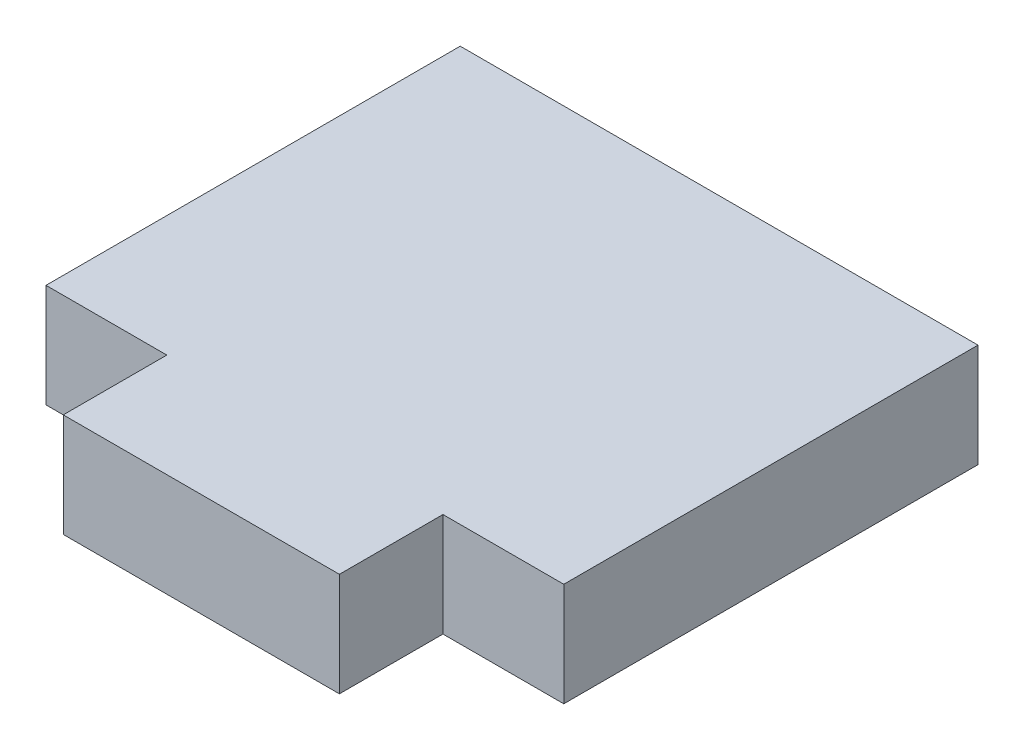
ISO-10303-21;
HEADER;
FILE_DESCRIPTION(('STEP AP214'),'2;1');
FILE_NAME('part.step','',(''),(''),'','','');
FILE_SCHEMA(('AUTOMOTIVE_DESIGN { 1 0 10303 214 1 1 1 1 }'));
ENDSEC;
DATA;
#1=APPLICATION_CONTEXT('core data for automotive mechanical design processes');
#2=APPLICATION_PROTOCOL_DEFINITION('international standard','automotive_design',2000,#1);
#3=PRODUCT_CONTEXT('',#1,'mechanical');
#4=PRODUCT('Part','Part','',(#3));
#5=PRODUCT_RELATED_PRODUCT_CATEGORY('part','',(#4));
#6=PRODUCT_DEFINITION_FORMATION('','',#4);
#7=PRODUCT_DEFINITION_CONTEXT('part definition',#1,'design');
#8=PRODUCT_DEFINITION('design','',#6,#7);
#9=PRODUCT_DEFINITION_SHAPE('','',#8);
#10=(LENGTH_UNIT() NAMED_UNIT(*) SI_UNIT(.MILLI.,.METRE.));
#11=(NAMED_UNIT(*) PLANE_ANGLE_UNIT() SI_UNIT($,.RADIAN.));
#12=(NAMED_UNIT(*) SI_UNIT($,.STERADIAN.) SOLID_ANGLE_UNIT());
#13=UNCERTAINTY_MEASURE_WITH_UNIT(LENGTH_MEASURE(1.E-05),#10,'distance_accuracy_value','');
#14=(GEOMETRIC_REPRESENTATION_CONTEXT(3) GLOBAL_UNCERTAINTY_ASSIGNED_CONTEXT((#13)) GLOBAL_UNIT_ASSIGNED_CONTEXT((#10,
#11,#12)) REPRESENTATION_CONTEXT('',''));
#15=CARTESIAN_POINT('',(0.,0.,0.));
#16=DIRECTION('',(0.,0.,1.));
#17=DIRECTION('',(1.,0.,0.));
#18=AXIS2_PLACEMENT_3D('',#15,#16,#17);
#19=CARTESIAN_POINT('',(-7.5,1.5,6.));
#20=DIRECTION('',(0.,0.,-1.));
#21=DIRECTION('',(-1.,0.,0.));
#22=AXIS2_PLACEMENT_3D('',#19,#20,#21);
#23=PLANE('',#22);
#24=DIRECTION('',(0.,-1.,0.));
#25=VECTOR('',#24,1.);
#26=CARTESIAN_POINT('',(-4.,1.5,6.));
#27=LINE('',#26,#25);
#28=CARTESIAN_POINT('',(-4.,1.5,6.));
#29=VERTEX_POINT('',#28);
#30=CARTESIAN_POINT('',(-4.,-1.5,6.));
#31=VERTEX_POINT('',#30);
#32=EDGE_CURVE('E190',#29,#31,#27,.T.);
#33=ORIENTED_EDGE('',*,*,#32,.F.);
#34=DIRECTION('',(1.,0.,0.));
#35=VECTOR('',#34,1.);
#36=CARTESIAN_POINT('',(-7.5,1.5,6.));
#37=LINE('',#36,#35);
#38=CARTESIAN_POINT('',(-7.5,1.5,6.));
#39=VERTEX_POINT('',#38);
#40=EDGE_CURVE('E89',#39,#29,#37,.T.);
#41=ORIENTED_EDGE('',*,*,#40,.F.);
#42=DIRECTION('',(0.,-1.,0.));
#43=VECTOR('',#42,1.);
#44=CARTESIAN_POINT('',(-7.5,1.5,6.));
#45=LINE('',#44,#43);
#46=CARTESIAN_POINT('',(-7.5,-1.5,6.));
#47=VERTEX_POINT('',#46);
#48=EDGE_CURVE('E11',#39,#47,#45,.T.);
#49=ORIENTED_EDGE('',*,*,#48,.T.);
#50=DIRECTION('',(1.,0.,0.));
#51=VECTOR('',#50,1.);
#52=CARTESIAN_POINT('',(-7.5,-1.5,6.));
#53=LINE('',#52,#51);
#54=EDGE_CURVE('E148',#47,#31,#53,.T.);
#55=ORIENTED_EDGE('',*,*,#54,.T.);
#56=EDGE_LOOP('',(#33,#41,#49,#55));
#57=FACE_BOUND('',#56,.T.);
#58=ADVANCED_FACE('F37',(#57),#23,.F.);
#59=CARTESIAN_POINT('',(-7.5,1.5,-6.));
#60=DIRECTION('',(1.,0.,0.));
#61=DIRECTION('',(0.,0.,-1.));
#62=AXIS2_PLACEMENT_3D('',#59,#60,#61);
#63=PLANE('',#62);
#64=DIRECTION('',(0.,0.,1.));
#65=VECTOR('',#64,1.);
#66=CARTESIAN_POINT('',(-7.5,-1.5,-6.));
#67=LINE('',#66,#65);
#68=CARTESIAN_POINT('',(-7.5,-1.5,-6.));
#69=VERTEX_POINT('',#68);
#70=EDGE_CURVE('E131',#69,#47,#67,.T.);
#71=ORIENTED_EDGE('',*,*,#70,.T.);
#72=ORIENTED_EDGE('',*,*,#48,.F.);
#73=DIRECTION('',(0.,0.,1.));
#74=VECTOR('',#73,1.);
#75=CARTESIAN_POINT('',(-7.5,1.5,-6.));
#76=LINE('',#75,#74);
#77=CARTESIAN_POINT('',(-7.5,1.5,-6.));
#78=VERTEX_POINT('',#77);
#79=EDGE_CURVE('E140',#78,#39,#76,.T.);
#80=ORIENTED_EDGE('',*,*,#79,.F.);
#81=DIRECTION('',(0.,-1.,0.));
#82=VECTOR('',#81,1.);
#83=CARTESIAN_POINT('',(-7.5,1.5,-6.));
#84=LINE('',#83,#82);
#85=EDGE_CURVE('E146',#78,#69,#84,.T.);
#86=ORIENTED_EDGE('',*,*,#85,.T.);
#87=EDGE_LOOP('',(#71,#72,#80,#86));
#88=FACE_BOUND('',#87,.T.);
#89=ADVANCED_FACE('F39',(#88),#63,.F.);
#90=CARTESIAN_POINT('',(4.,1.5,6.));
#91=VERTEX_POINT('',#90);
#92=CARTESIAN_POINT('',(7.5,1.5,6.));
#93=VERTEX_POINT('',#92);
#94=EDGE_CURVE('E142',#91,#93,#37,.T.);
#95=ORIENTED_EDGE('',*,*,#94,.F.);
#96=DIRECTION('',(0.,-1.,0.));
#97=VECTOR('',#96,1.);
#98=CARTESIAN_POINT('',(4.,1.5,6.));
#99=LINE('',#98,#97);
#100=CARTESIAN_POINT('',(4.,-1.5,6.));
#101=VERTEX_POINT('',#100);
#102=EDGE_CURVE('E136',#91,#101,#99,.T.);
#103=ORIENTED_EDGE('',*,*,#102,.T.);
#104=CARTESIAN_POINT('',(7.5,-1.5,6.));
#105=VERTEX_POINT('',#104);
#106=EDGE_CURVE('E134',#101,#105,#53,.T.);
#107=ORIENTED_EDGE('',*,*,#106,.T.);
#108=DIRECTION('',(0.,-1.,0.));
#109=VECTOR('',#108,1.);
#110=CARTESIAN_POINT('',(7.5,1.5,6.));
#111=LINE('',#110,#109);
#112=EDGE_CURVE('E45',#93,#105,#111,.T.);
#113=ORIENTED_EDGE('',*,*,#112,.F.);
#114=EDGE_LOOP('',(#95,#103,#107,#113));
#115=FACE_BOUND('',#114,.T.);
#116=ADVANCED_FACE('F180',(#115),#23,.F.);
#117=CARTESIAN_POINT('',(7.5,1.5,-6.));
#118=DIRECTION('',(-1.,0.,0.));
#119=DIRECTION('',(0.,0.,1.));
#120=AXIS2_PLACEMENT_3D('',#117,#118,#119);
#121=PLANE('',#120);
#122=DIRECTION('',(0.,0.,-1.));
#123=VECTOR('',#122,1.);
#124=CARTESIAN_POINT('',(7.5,-1.5,-6.));
#125=LINE('',#124,#123);
#126=CARTESIAN_POINT('',(7.5,-1.5,-6.));
#127=VERTEX_POINT('',#126);
#128=EDGE_CURVE('E151',#105,#127,#125,.T.);
#129=ORIENTED_EDGE('',*,*,#128,.T.);
#130=DIRECTION('',(0.,-1.,0.));
#131=VECTOR('',#130,1.);
#132=CARTESIAN_POINT('',(7.5,1.5,-6.));
#133=LINE('',#132,#131);
#134=CARTESIAN_POINT('',(7.5,1.5,-6.));
#135=VERTEX_POINT('',#134);
#136=EDGE_CURVE('E155',#135,#127,#133,.T.);
#137=ORIENTED_EDGE('',*,*,#136,.F.);
#138=DIRECTION('',(0.,0.,-1.));
#139=VECTOR('',#138,1.);
#140=CARTESIAN_POINT('',(7.5,1.5,-6.));
#141=LINE('',#140,#139);
#142=EDGE_CURVE('E144',#93,#135,#141,.T.);
#143=ORIENTED_EDGE('',*,*,#142,.F.);
#144=ORIENTED_EDGE('',*,*,#112,.T.);
#145=EDGE_LOOP('',(#129,#137,#143,#144));
#146=FACE_BOUND('',#145,.T.);
#147=ADVANCED_FACE('F161',(#146),#121,.F.);
#148=CARTESIAN_POINT('',(-7.5,1.5,-6.));
#149=DIRECTION('',(0.,0.,1.));
#150=DIRECTION('',(1.,0.,0.));
#151=AXIS2_PLACEMENT_3D('',#148,#149,#150);
#152=PLANE('',#151);
#153=DIRECTION('',(-1.,0.,0.));
#154=VECTOR('',#153,1.);
#155=CARTESIAN_POINT('',(-7.5,-1.5,-6.));
#156=LINE('',#155,#154);
#157=EDGE_CURVE('E82',#127,#69,#156,.T.);
#158=ORIENTED_EDGE('',*,*,#157,.T.);
#159=ORIENTED_EDGE('',*,*,#85,.F.);
#160=DIRECTION('',(-1.,0.,0.));
#161=VECTOR('',#160,1.);
#162=CARTESIAN_POINT('',(-7.5,1.5,-6.));
#163=LINE('',#162,#161);
#164=EDGE_CURVE('E61',#135,#78,#163,.T.);
#165=ORIENTED_EDGE('',*,*,#164,.F.);
#166=ORIENTED_EDGE('',*,*,#136,.T.);
#167=EDGE_LOOP('',(#158,#159,#165,#166));
#168=FACE_BOUND('',#167,.T.);
#169=ADVANCED_FACE('F172',(#168),#152,.F.);
#170=CARTESIAN_POINT('',(0.,1.5,0.));
#171=DIRECTION('',(0.,1.,0.));
#172=DIRECTION('',(0.,0.,1.));
#173=AXIS2_PLACEMENT_3D('',#170,#171,#172);
#174=PLANE('',#173);
#175=ORIENTED_EDGE('',*,*,#79,.T.);
#176=ORIENTED_EDGE('',*,*,#40,.T.);
#177=DIRECTION('',(0.,0.,1.));
#178=VECTOR('',#177,1.);
#179=CARTESIAN_POINT('',(-4.,1.5,6.));
#180=LINE('',#179,#178);
#181=CARTESIAN_POINT('',(-4.,1.5,9.));
#182=VERTEX_POINT('',#181);
#183=EDGE_CURVE('E123',#29,#182,#180,.T.);
#184=ORIENTED_EDGE('',*,*,#183,.T.);
#185=DIRECTION('',(1.,0.,0.));
#186=VECTOR('',#185,1.);
#187=CARTESIAN_POINT('',(-4.,1.5,9.));
#188=LINE('',#187,#186);
#189=CARTESIAN_POINT('',(4.,1.5,9.));
#190=VERTEX_POINT('',#189);
#191=EDGE_CURVE('E114',#182,#190,#188,.T.);
#192=ORIENTED_EDGE('',*,*,#191,.T.);
#193=DIRECTION('',(0.,0.,-1.));
#194=VECTOR('',#193,1.);
#195=CARTESIAN_POINT('',(4.,1.5,6.));
#196=LINE('',#195,#194);
#197=EDGE_CURVE('E122',#190,#91,#196,.T.);
#198=ORIENTED_EDGE('',*,*,#197,.T.);
#199=ORIENTED_EDGE('',*,*,#94,.T.);
#200=ORIENTED_EDGE('',*,*,#142,.T.);
#201=ORIENTED_EDGE('',*,*,#164,.T.);
#202=EDGE_LOOP('',(#175,#176,#184,#192,#198,#199,#200,#201));
#203=FACE_BOUND('',#202,.T.);
#204=ADVANCED_FACE('F125',(#203),#174,.T.);
#205=CARTESIAN_POINT('',(0.,-1.5,0.));
#206=DIRECTION('',(0.,1.,0.));
#207=DIRECTION('',(0.,0.,1.));
#208=AXIS2_PLACEMENT_3D('',#205,#206,#207);
#209=PLANE('',#208);
#210=ORIENTED_EDGE('',*,*,#70,.F.);
#211=ORIENTED_EDGE('',*,*,#157,.F.);
#212=ORIENTED_EDGE('',*,*,#128,.F.);
#213=ORIENTED_EDGE('',*,*,#106,.F.);
#214=DIRECTION('',(0.,0.,-1.));
#215=VECTOR('',#214,1.);
#216=CARTESIAN_POINT('',(4.,-1.5,6.));
#217=LINE('',#216,#215);
#218=CARTESIAN_POINT('',(4.,-1.5,9.));
#219=VERTEX_POINT('',#218);
#220=EDGE_CURVE('E52',#219,#101,#217,.T.);
#221=ORIENTED_EDGE('',*,*,#220,.F.);
#222=DIRECTION('',(1.,0.,0.));
#223=VECTOR('',#222,1.);
#224=CARTESIAN_POINT('',(-4.,-1.5,9.));
#225=LINE('',#224,#223);
#226=CARTESIAN_POINT('',(-4.,-1.5,9.));
#227=VERTEX_POINT('',#226);
#228=EDGE_CURVE('E196',#227,#219,#225,.T.);
#229=ORIENTED_EDGE('',*,*,#228,.F.);
#230=DIRECTION('',(0.,0.,1.));
#231=VECTOR('',#230,1.);
#232=CARTESIAN_POINT('',(-4.,-1.5,6.));
#233=LINE('',#232,#231);
#234=EDGE_CURVE('E130',#31,#227,#233,.T.);
#235=ORIENTED_EDGE('',*,*,#234,.F.);
#236=ORIENTED_EDGE('',*,*,#54,.F.);
#237=EDGE_LOOP('',(#210,#211,#212,#213,#221,#229,#235,#236));
#238=FACE_BOUND('',#237,.T.);
#239=ADVANCED_FACE('F168',(#238),#209,.F.);
#240=CARTESIAN_POINT('',(-4.,1.5,6.));
#241=DIRECTION('',(1.,0.,0.));
#242=DIRECTION('',(0.,0.,-1.));
#243=AXIS2_PLACEMENT_3D('',#240,#241,#242);
#244=PLANE('',#243);
#245=ORIENTED_EDGE('',*,*,#234,.T.);
#246=DIRECTION('',(0.,-1.,0.));
#247=VECTOR('',#246,1.);
#248=CARTESIAN_POINT('',(-4.,1.5,9.));
#249=LINE('',#248,#247);
#250=EDGE_CURVE('E118',#182,#227,#249,.T.);
#251=ORIENTED_EDGE('',*,*,#250,.F.);
#252=ORIENTED_EDGE('',*,*,#183,.F.);
#253=ORIENTED_EDGE('',*,*,#32,.T.);
#254=EDGE_LOOP('',(#245,#251,#252,#253));
#255=FACE_BOUND('',#254,.T.);
#256=ADVANCED_FACE('F128',(#255),#244,.F.);
#257=CARTESIAN_POINT('',(-4.,1.5,9.));
#258=DIRECTION('',(0.,0.,-1.));
#259=DIRECTION('',(-1.,0.,0.));
#260=AXIS2_PLACEMENT_3D('',#257,#258,#259);
#261=PLANE('',#260);
#262=ORIENTED_EDGE('',*,*,#228,.T.);
#263=DIRECTION('',(0.,-1.,0.));
#264=VECTOR('',#263,1.);
#265=CARTESIAN_POINT('',(4.,1.5,9.));
#266=LINE('',#265,#264);
#267=EDGE_CURVE('E120',#190,#219,#266,.T.);
#268=ORIENTED_EDGE('',*,*,#267,.F.);
#269=ORIENTED_EDGE('',*,*,#191,.F.);
#270=ORIENTED_EDGE('',*,*,#250,.T.);
#271=EDGE_LOOP('',(#262,#268,#269,#270));
#272=FACE_BOUND('',#271,.T.);
#273=ADVANCED_FACE('F116',(#272),#261,.F.);
#274=CARTESIAN_POINT('',(4.,1.5,6.));
#275=DIRECTION('',(-1.,0.,0.));
#276=DIRECTION('',(0.,0.,1.));
#277=AXIS2_PLACEMENT_3D('',#274,#275,#276);
#278=PLANE('',#277);
#279=ORIENTED_EDGE('',*,*,#220,.T.);
#280=ORIENTED_EDGE('',*,*,#102,.F.);
#281=ORIENTED_EDGE('',*,*,#197,.F.);
#282=ORIENTED_EDGE('',*,*,#267,.T.);
#283=EDGE_LOOP('',(#279,#280,#281,#282));
#284=FACE_BOUND('',#283,.T.);
#285=ADVANCED_FACE('F192',(#284),#278,.F.);
#286=CLOSED_SHELL('',(#58,#89,#116,#147,#169,#204,#239,#256,#273,#285));
#287=MANIFOLD_SOLID_BREP('B2',#286);
#288=ADVANCED_BREP_SHAPE_REPRESENTATION('',(#18,#287),#14);
#289=SHAPE_DEFINITION_REPRESENTATION(#9,#288);
ENDSEC;
END-ISO-10303-21;
